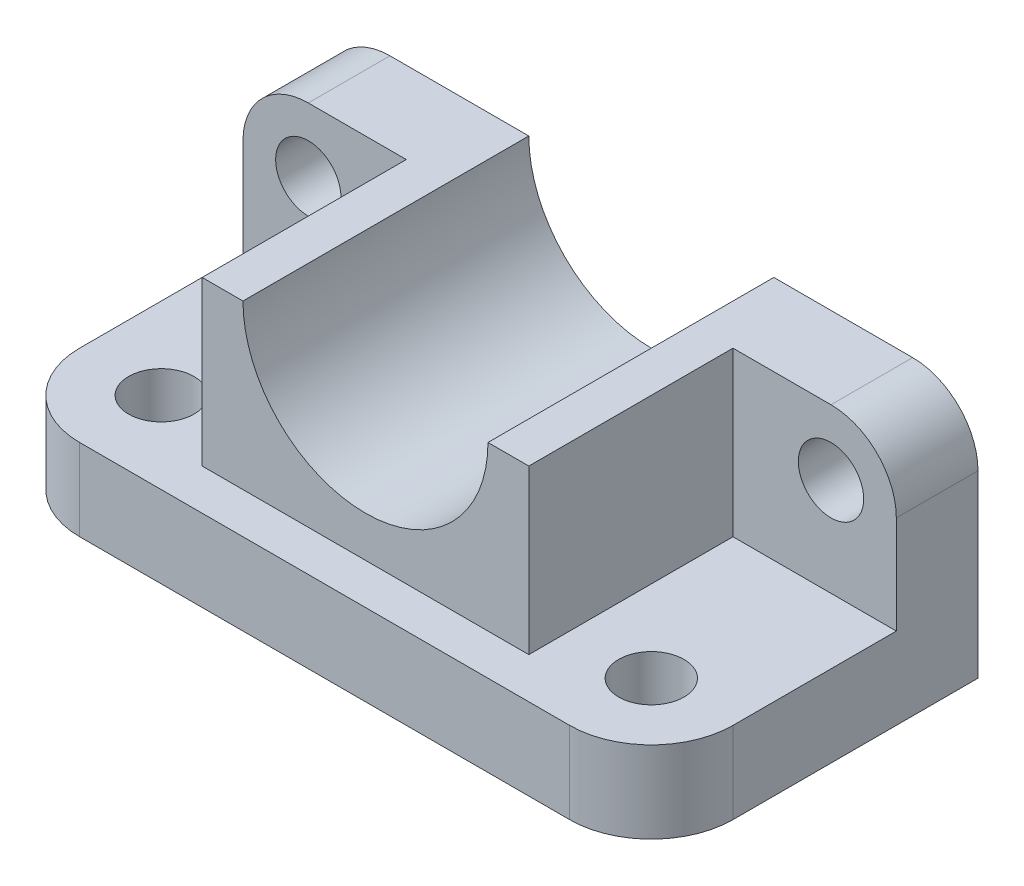
ISO-10303-21;
HEADER;
FILE_DESCRIPTION(('STEP AP214'),'2;1');
FILE_NAME('part.step','',(''),(''),'','','');
FILE_SCHEMA(('AUTOMOTIVE_DESIGN { 1 0 10303 214 1 1 1 1 }'));
ENDSEC;
DATA;
#1=APPLICATION_CONTEXT('core data for automotive mechanical design processes');
#2=APPLICATION_PROTOCOL_DEFINITION('international standard','automotive_design',2000,#1);
#3=PRODUCT_CONTEXT('',#1,'mechanical');
#4=PRODUCT('Part','Part','',(#3));
#5=PRODUCT_RELATED_PRODUCT_CATEGORY('part','',(#4));
#6=PRODUCT_DEFINITION_FORMATION('','',#4);
#7=PRODUCT_DEFINITION_CONTEXT('part definition',#1,'design');
#8=PRODUCT_DEFINITION('design','',#6,#7);
#9=PRODUCT_DEFINITION_SHAPE('','',#8);
#10=(LENGTH_UNIT() NAMED_UNIT(*) SI_UNIT(.MILLI.,.METRE.));
#11=(NAMED_UNIT(*) PLANE_ANGLE_UNIT() SI_UNIT($,.RADIAN.));
#12=(NAMED_UNIT(*) SI_UNIT($,.STERADIAN.) SOLID_ANGLE_UNIT());
#13=UNCERTAINTY_MEASURE_WITH_UNIT(LENGTH_MEASURE(1.E-05),#10,'distance_accuracy_value','');
#14=(GEOMETRIC_REPRESENTATION_CONTEXT(3) GLOBAL_UNCERTAINTY_ASSIGNED_CONTEXT((#13)) GLOBAL_UNIT_ASSIGNED_CONTEXT((#10,
#11,#12)) REPRESENTATION_CONTEXT('',''));
#15=CARTESIAN_POINT('',(0.,0.,0.));
#16=DIRECTION('',(0.,0.,1.));
#17=DIRECTION('',(1.,0.,0.));
#18=AXIS2_PLACEMENT_3D('',#15,#16,#17);
#19=CARTESIAN_POINT('',(-30.,30.,10.));
#20=DIRECTION('',(0.,-1.,0.));
#21=DIRECTION('',(0.,0.,-1.));
#22=AXIS2_PLACEMENT_3D('',#19,#20,#21);
#23=PLANE('',#22);
#24=DIRECTION('',(-1.,0.,0.));
#25=VECTOR('',#24,1.);
#26=CARTESIAN_POINT('',(-40.,30.,-20.));
#27=LINE('',#26,#25);
#28=CARTESIAN_POINT('',(32.,30.,-20.));
#29=VERTEX_POINT('',#28);
#30=CARTESIAN_POINT('',(15.,30.,-20.));
#31=VERTEX_POINT('',#30);
#32=EDGE_CURVE('E158',#29,#31,#27,.T.);
#33=ORIENTED_EDGE('',*,*,#32,.T.);
#34=DIRECTION('',(0.,0.,1.));
#35=VECTOR('',#34,1.);
#36=CARTESIAN_POINT('',(15.,30.,-20.));
#37=LINE('',#36,#35);
#38=CARTESIAN_POINT('',(15.,30.,15.));
#39=VERTEX_POINT('',#38);
#40=EDGE_CURVE('E145',#31,#39,#37,.T.);
#41=ORIENTED_EDGE('',*,*,#40,.T.);
#42=DIRECTION('',(-1.,0.,0.));
#43=VECTOR('',#42,1.);
#44=CARTESIAN_POINT('',(20.,30.,15.));
#45=LINE('',#44,#43);
#46=CARTESIAN_POINT('',(20.,30.,15.));
#47=VERTEX_POINT('',#46);
#48=EDGE_CURVE('E263',#47,#39,#45,.T.);
#49=ORIENTED_EDGE('',*,*,#48,.F.);
#50=DIRECTION('',(0.,0.,1.));
#51=VECTOR('',#50,1.);
#52=CARTESIAN_POINT('',(20.,30.,15.));
#53=LINE('',#52,#51);
#54=CARTESIAN_POINT('',(20.,30.,-10.));
#55=VERTEX_POINT('',#54);
#56=EDGE_CURVE('E259',#55,#47,#53,.T.);
#57=ORIENTED_EDGE('',*,*,#56,.F.);
#58=DIRECTION('',(-1.,0.,0.));
#59=VECTOR('',#58,1.);
#60=CARTESIAN_POINT('',(40.,30.,-10.));
#61=LINE('',#60,#59);
#62=CARTESIAN_POINT('',(32.,30.,-10.));
#63=VERTEX_POINT('',#62);
#64=EDGE_CURVE('E226',#63,#55,#61,.T.);
#65=ORIENTED_EDGE('',*,*,#64,.F.);
#66=DIRECTION('',(0.,0.,-1.));
#67=VECTOR('',#66,1.);
#68=CARTESIAN_POINT('',(32.,30.,10.));
#69=LINE('',#68,#67);
#70=EDGE_CURVE('E166',#63,#29,#69,.T.);
#71=ORIENTED_EDGE('',*,*,#70,.T.);
#72=EDGE_LOOP('',(#33,#41,#49,#57,#65,#71));
#73=FACE_BOUND('',#72,.T.);
#74=ADVANCED_FACE('F34',(#73),#23,.F.);
#75=CARTESIAN_POINT('',(-30.,30.,10.));
#76=DIRECTION('',(0.,-1.,0.));
#77=DIRECTION('',(0.,0.,-1.));
#78=AXIS2_PLACEMENT_3D('',#75,#76,#77);
#79=CYLINDRICAL_SURFACE('',#78,10.);
#80=CARTESIAN_POINT('',(-30.,10.,10.));
#81=DIRECTION('',(0.,1.,0.));
#82=DIRECTION('',(0.,0.,1.));
#83=AXIS2_PLACEMENT_3D('',#80,#81,#82);
#84=CIRCLE('',#83,10.);
#85=CARTESIAN_POINT('',(-40.,10.,9.99999999999993));
#86=VERTEX_POINT('',#85);
#87=CARTESIAN_POINT('',(-30.,10.,20.));
#88=VERTEX_POINT('',#87);
#89=EDGE_CURVE('E253',#86,#88,#84,.T.);
#90=ORIENTED_EDGE('',*,*,#89,.F.);
#91=DIRECTION('',(0.,-1.,0.));
#92=VECTOR('',#91,1.);
#93=CARTESIAN_POINT('',(-40.,30.,9.99999999999993));
#94=LINE('',#93,#92);
#95=CARTESIAN_POINT('',(-40.,0.,9.99999999999993));
#96=VERTEX_POINT('',#95);
#97=EDGE_CURVE('E196',#86,#96,#94,.T.);
#98=ORIENTED_EDGE('',*,*,#97,.T.);
#99=CARTESIAN_POINT('',(-30.,0.,10.));
#100=DIRECTION('',(0.,1.,0.));
#101=DIRECTION('',(0.,0.,-1.));
#102=AXIS2_PLACEMENT_3D('',#99,#100,#101);
#103=CIRCLE('',#102,10.);
#104=CARTESIAN_POINT('',(-29.9999999999999,0.,20.));
#105=VERTEX_POINT('',#104);
#106=EDGE_CURVE('E185',#96,#105,#103,.T.);
#107=ORIENTED_EDGE('',*,*,#106,.T.);
#108=DIRECTION('',(0.,-1.,0.));
#109=VECTOR('',#108,1.);
#110=CARTESIAN_POINT('',(-29.9999999999999,30.,20.));
#111=LINE('',#110,#109);
#112=EDGE_CURVE('E194',#88,#105,#111,.T.);
#113=ORIENTED_EDGE('',*,*,#112,.F.);
#114=EDGE_LOOP('',(#90,#98,#107,#113));
#115=FACE_BOUND('',#114,.T.);
#116=ADVANCED_FACE('F351',(#115),#79,.T.);
#117=CARTESIAN_POINT('',(-29.9999999999999,30.,20.));
#118=DIRECTION('',(0.,0.,-1.));
#119=DIRECTION('',(-1.,0.,0.));
#120=AXIS2_PLACEMENT_3D('',#117,#118,#119);
#121=PLANE('',#120);
#122=DIRECTION('',(1.,0.,0.));
#123=VECTOR('',#122,1.);
#124=CARTESIAN_POINT('',(-29.9999999999999,10.,20.));
#125=LINE('',#124,#123);
#126=CARTESIAN_POINT('',(29.9999999999999,10.,20.));
#127=VERTEX_POINT('',#126);
#128=EDGE_CURVE('E255',#88,#127,#125,.T.);
#129=ORIENTED_EDGE('',*,*,#128,.F.);
#130=ORIENTED_EDGE('',*,*,#112,.T.);
#131=DIRECTION('',(1.,0.,0.));
#132=VECTOR('',#131,1.);
#133=CARTESIAN_POINT('',(-29.9999999999999,0.,20.));
#134=LINE('',#133,#132);
#135=CARTESIAN_POINT('',(29.9999999999999,0.,20.));
#136=VERTEX_POINT('',#135);
#137=EDGE_CURVE('E188',#105,#136,#134,.T.);
#138=ORIENTED_EDGE('',*,*,#137,.T.);
#139=DIRECTION('',(0.,-1.,0.));
#140=VECTOR('',#139,1.);
#141=CARTESIAN_POINT('',(29.9999999999999,30.,20.));
#142=LINE('',#141,#140);
#143=EDGE_CURVE('E169',#127,#136,#142,.T.);
#144=ORIENTED_EDGE('',*,*,#143,.F.);
#145=EDGE_LOOP('',(#129,#130,#138,#144));
#146=FACE_BOUND('',#145,.T.);
#147=ADVANCED_FACE('F354',(#146),#121,.F.);
#148=CARTESIAN_POINT('',(30.,30.,10.));
#149=DIRECTION('',(0.,-1.,0.));
#150=DIRECTION('',(0.,0.,-1.));
#151=AXIS2_PLACEMENT_3D('',#148,#149,#150);
#152=CYLINDRICAL_SURFACE('',#151,10.);
#153=CARTESIAN_POINT('',(30.,10.,10.));
#154=DIRECTION('',(0.,1.,0.));
#155=DIRECTION('',(0.,0.,1.));
#156=AXIS2_PLACEMENT_3D('',#153,#154,#155);
#157=CIRCLE('',#156,10.);
#158=CARTESIAN_POINT('',(40.,10.,9.99999999999993));
#159=VERTEX_POINT('',#158);
#160=EDGE_CURVE('E230',#127,#159,#157,.T.);
#161=ORIENTED_EDGE('',*,*,#160,.F.);
#162=ORIENTED_EDGE('',*,*,#143,.T.);
#163=CARTESIAN_POINT('',(30.,0.,10.));
#164=DIRECTION('',(0.,1.,0.));
#165=DIRECTION('',(0.,0.,-1.));
#166=AXIS2_PLACEMENT_3D('',#163,#164,#165);
#167=CIRCLE('',#166,10.);
#168=CARTESIAN_POINT('',(40.,0.,9.99999999999993));
#169=VERTEX_POINT('',#168);
#170=EDGE_CURVE('E171',#136,#169,#167,.T.);
#171=ORIENTED_EDGE('',*,*,#170,.T.);
#172=DIRECTION('',(0.,-1.,0.));
#173=VECTOR('',#172,1.);
#174=CARTESIAN_POINT('',(40.,30.,9.99999999999993));
#175=LINE('',#174,#173);
#176=EDGE_CURVE('E167',#159,#169,#175,.T.);
#177=ORIENTED_EDGE('',*,*,#176,.F.);
#178=EDGE_LOOP('',(#161,#162,#171,#177));
#179=FACE_BOUND('',#178,.T.);
#180=ADVANCED_FACE('F297',(#179),#152,.T.);
#181=CARTESIAN_POINT('',(-30.,30.,10.));
#182=DIRECTION('',(0.,-1.,0.));
#183=DIRECTION('',(0.,0.,-1.));
#184=AXIS2_PLACEMENT_3D('',#181,#182,#183);
#185=CYLINDRICAL_SURFACE('',#184,4.);
#186=CARTESIAN_POINT('',(-30.,0.,10.));
#187=DIRECTION('',(0.,1.,0.));
#188=DIRECTION('',(0.,0.,1.));
#189=AXIS2_PLACEMENT_3D('',#186,#187,#188);
#190=CIRCLE('',#189,4.);
#191=CARTESIAN_POINT('',(-30.,0.,14.));
#192=VERTEX_POINT('',#191);
#193=EDGE_CURVE('E174',#192,#192,#190,.T.);
#194=ORIENTED_EDGE('',*,*,#193,.F.);
#195=EDGE_LOOP('',(#194));
#196=FACE_BOUND('',#195,.T.);
#197=CARTESIAN_POINT('',(-30.,10.,10.));
#198=DIRECTION('',(0.,1.,0.));
#199=DIRECTION('',(0.,0.,1.));
#200=AXIS2_PLACEMENT_3D('',#197,#198,#199);
#201=CIRCLE('',#200,4.);
#202=CARTESIAN_POINT('',(-30.,10.,14.));
#203=VERTEX_POINT('',#202);
#204=EDGE_CURVE('E206',#203,#203,#201,.T.);
#205=ORIENTED_EDGE('',*,*,#204,.T.);
#206=EDGE_LOOP('',(#205));
#207=FACE_BOUND('',#206,.T.);
#208=ADVANCED_FACE('F293',(#196,#207),#185,.F.);
#209=CARTESIAN_POINT('',(30.,30.,10.));
#210=DIRECTION('',(0.,-1.,0.));
#211=DIRECTION('',(0.,0.,-1.));
#212=AXIS2_PLACEMENT_3D('',#209,#210,#211);
#213=CYLINDRICAL_SURFACE('',#212,4.);
#214=CARTESIAN_POINT('',(30.,0.,10.));
#215=DIRECTION('',(0.,1.,0.));
#216=DIRECTION('',(0.,0.,1.));
#217=AXIS2_PLACEMENT_3D('',#214,#215,#216);
#218=CIRCLE('',#217,4.);
#219=CARTESIAN_POINT('',(30.,0.,14.));
#220=VERTEX_POINT('',#219);
#221=EDGE_CURVE('E283',#220,#220,#218,.T.);
#222=ORIENTED_EDGE('',*,*,#221,.F.);
#223=EDGE_LOOP('',(#222));
#224=FACE_BOUND('',#223,.T.);
#225=CARTESIAN_POINT('',(30.,10.,10.));
#226=DIRECTION('',(0.,1.,0.));
#227=DIRECTION('',(0.,0.,1.));
#228=AXIS2_PLACEMENT_3D('',#225,#226,#227);
#229=CIRCLE('',#228,4.);
#230=CARTESIAN_POINT('',(30.,10.,14.));
#231=VERTEX_POINT('',#230);
#232=EDGE_CURVE('E203',#231,#231,#229,.T.);
#233=ORIENTED_EDGE('',*,*,#232,.T.);
#234=EDGE_LOOP('',(#233));
#235=FACE_BOUND('',#234,.T.);
#236=ADVANCED_FACE('F296',(#224,#235),#213,.F.);
#237=CARTESIAN_POINT('',(-15.,30.,15.));
#238=VERTEX_POINT('',#237);
#239=CARTESIAN_POINT('',(-20.,30.,15.));
#240=VERTEX_POINT('',#239);
#241=EDGE_CURVE('E262',#238,#240,#45,.T.);
#242=ORIENTED_EDGE('',*,*,#241,.F.);
#243=DIRECTION('',(0.,0.,1.));
#244=VECTOR('',#243,1.);
#245=CARTESIAN_POINT('',(-15.,30.,-20.));
#246=LINE('',#245,#244);
#247=CARTESIAN_POINT('',(-15.,30.,-20.));
#248=VERTEX_POINT('',#247);
#249=EDGE_CURVE('E50',#248,#238,#246,.T.);
#250=ORIENTED_EDGE('',*,*,#249,.F.);
#251=CARTESIAN_POINT('',(-32.,30.,-20.));
#252=VERTEX_POINT('',#251);
#253=EDGE_CURVE('E160',#248,#252,#27,.T.);
#254=ORIENTED_EDGE('',*,*,#253,.T.);
#255=DIRECTION('',(0.,0.,1.));
#256=VECTOR('',#255,1.);
#257=CARTESIAN_POINT('',(-32.,30.,10.));
#258=LINE('',#257,#256);
#259=CARTESIAN_POINT('',(-32.,30.,-10.));
#260=VERTEX_POINT('',#259);
#261=EDGE_CURVE('E202',#252,#260,#258,.T.);
#262=ORIENTED_EDGE('',*,*,#261,.T.);
#263=DIRECTION('',(-1.,0.,0.));
#264=VECTOR('',#263,1.);
#265=CARTESIAN_POINT('',(-20.,30.,-10.));
#266=LINE('',#265,#264);
#267=CARTESIAN_POINT('',(-20.,30.,-10.));
#268=VERTEX_POINT('',#267);
#269=EDGE_CURVE('E233',#268,#260,#266,.T.);
#270=ORIENTED_EDGE('',*,*,#269,.F.);
#271=DIRECTION('',(0.,0.,-1.));
#272=VECTOR('',#271,1.);
#273=CARTESIAN_POINT('',(-20.,30.,-10.));
#274=LINE('',#273,#272);
#275=EDGE_CURVE('E265',#240,#268,#274,.T.);
#276=ORIENTED_EDGE('',*,*,#275,.F.);
#277=EDGE_LOOP('',(#242,#250,#254,#262,#270,#276));
#278=FACE_BOUND('',#277,.T.);
#279=ADVANCED_FACE('F365',(#278),#23,.F.);
#280=CARTESIAN_POINT('',(-30.,0.,10.));
#281=DIRECTION('',(0.,-1.,0.));
#282=DIRECTION('',(0.,0.,-1.));
#283=AXIS2_PLACEMENT_3D('',#280,#281,#282);
#284=PLANE('',#283);
#285=ORIENTED_EDGE('',*,*,#193,.T.);
#286=EDGE_LOOP('',(#285));
#287=FACE_BOUND('',#286,.T.);
#288=DIRECTION('',(0.,0.,-1.));
#289=VECTOR('',#288,1.);
#290=CARTESIAN_POINT('',(40.,0.,9.99999999999993));
#291=LINE('',#290,#289);
#292=CARTESIAN_POINT('',(40.,0.,-20.));
#293=VERTEX_POINT('',#292);
#294=EDGE_CURVE('E176',#169,#293,#291,.T.);
#295=ORIENTED_EDGE('',*,*,#294,.F.);
#296=ORIENTED_EDGE('',*,*,#170,.F.);
#297=ORIENTED_EDGE('',*,*,#137,.F.);
#298=ORIENTED_EDGE('',*,*,#106,.F.);
#299=DIRECTION('',(0.,0.,1.));
#300=VECTOR('',#299,1.);
#301=CARTESIAN_POINT('',(-40.,0.,9.99999999999993));
#302=LINE('',#301,#300);
#303=CARTESIAN_POINT('',(-40.,0.,-20.));
#304=VERTEX_POINT('',#303);
#305=EDGE_CURVE('E182',#304,#96,#302,.T.);
#306=ORIENTED_EDGE('',*,*,#305,.F.);
#307=DIRECTION('',(-1.,0.,0.));
#308=VECTOR('',#307,1.);
#309=CARTESIAN_POINT('',(-40.,0.,-20.));
#310=LINE('',#309,#308);
#311=EDGE_CURVE('E179',#293,#304,#310,.T.);
#312=ORIENTED_EDGE('',*,*,#311,.F.);
#313=EDGE_LOOP('',(#295,#296,#297,#298,#306,#312));
#314=FACE_BOUND('',#313,.T.);
#315=ORIENTED_EDGE('',*,*,#221,.T.);
#316=EDGE_LOOP('',(#315));
#317=FACE_BOUND('',#316,.T.);
#318=ADVANCED_FACE('F290',(#287,#314,#317),#284,.T.);
#319=CARTESIAN_POINT('',(40.,30.,9.99999999999993));
#320=DIRECTION('',(-1.,0.,0.));
#321=DIRECTION('',(0.,0.,1.));
#322=AXIS2_PLACEMENT_3D('',#319,#320,#321);
#323=PLANE('',#322);
#324=DIRECTION('',(0.,-1.,0.));
#325=VECTOR('',#324,1.);
#326=CARTESIAN_POINT('',(40.,30.,-20.));
#327=LINE('',#326,#325);
#328=CARTESIAN_POINT('',(40.,22.,-20.));
#329=VERTEX_POINT('',#328);
#330=EDGE_CURVE('E200',#329,#293,#327,.T.);
#331=ORIENTED_EDGE('',*,*,#330,.F.);
#332=DIRECTION('',(0.,0.,-1.));
#333=VECTOR('',#332,1.);
#334=CARTESIAN_POINT('',(40.,22.,9.99999999999993));
#335=LINE('',#334,#333);
#336=CARTESIAN_POINT('',(40.,22.,-10.));
#337=VERTEX_POINT('',#336);
#338=EDGE_CURVE('E215',#329,#337,#335,.F.);
#339=ORIENTED_EDGE('',*,*,#338,.T.);
#340=DIRECTION('',(0.,1.,0.));
#341=VECTOR('',#340,1.);
#342=CARTESIAN_POINT('',(40.,10.,-10.));
#343=LINE('',#342,#341);
#344=CARTESIAN_POINT('',(40.,10.,-10.));
#345=VERTEX_POINT('',#344);
#346=EDGE_CURVE('E257',#345,#337,#343,.T.);
#347=ORIENTED_EDGE('',*,*,#346,.F.);
#348=DIRECTION('',(0.,0.,-1.));
#349=VECTOR('',#348,1.);
#350=CARTESIAN_POINT('',(40.,10.,9.99999999999993));
#351=LINE('',#350,#349);
#352=EDGE_CURVE('E232',#159,#345,#351,.T.);
#353=ORIENTED_EDGE('',*,*,#352,.F.);
#354=ORIENTED_EDGE('',*,*,#176,.T.);
#355=ORIENTED_EDGE('',*,*,#294,.T.);
#356=EDGE_LOOP('',(#331,#339,#347,#353,#354,#355));
#357=FACE_BOUND('',#356,.T.);
#358=ADVANCED_FACE('F318',(#357),#323,.F.);
#359=CARTESIAN_POINT('',(-40.,30.,-20.));
#360=DIRECTION('',(0.,0.,1.));
#361=DIRECTION('',(1.,0.,0.));
#362=AXIS2_PLACEMENT_3D('',#359,#360,#361);
#363=PLANE('',#362);
#364=CARTESIAN_POINT('',(32.,22.,-20.));
#365=DIRECTION('',(0.,0.,1.));
#366=DIRECTION('',(1.,0.,0.));
#367=AXIS2_PLACEMENT_3D('',#364,#365,#366);
#368=CIRCLE('',#367,4.00000000000001);
#369=CARTESIAN_POINT('',(36.,22.,-20.));
#370=VERTEX_POINT('',#369);
#371=EDGE_CURVE('E543',#370,#370,#368,.T.);
#372=ORIENTED_EDGE('',*,*,#371,.T.);
#373=EDGE_LOOP('',(#372));
#374=FACE_BOUND('',#373,.T.);
#375=CARTESIAN_POINT('',(-32.,22.,-20.));
#376=DIRECTION('',(0.,0.,1.));
#377=DIRECTION('',(1.,0.,0.));
#378=AXIS2_PLACEMENT_3D('',#375,#376,#377);
#379=CIRCLE('',#378,4.);
#380=CARTESIAN_POINT('',(-28.,22.,-20.));
#381=VERTEX_POINT('',#380);
#382=EDGE_CURVE('E161',#381,#381,#379,.T.);
#383=ORIENTED_EDGE('',*,*,#382,.T.);
#384=EDGE_LOOP('',(#383));
#385=FACE_BOUND('',#384,.T.);
#386=ORIENTED_EDGE('',*,*,#253,.F.);
#387=CARTESIAN_POINT('',(0.,30.,-20.));
#388=DIRECTION('',(0.,0.,1.));
#389=DIRECTION('',(1.,0.,0.));
#390=AXIS2_PLACEMENT_3D('',#387,#388,#389);
#391=CIRCLE('',#390,15.);
#392=EDGE_CURVE('E148',#248,#31,#391,.T.);
#393=ORIENTED_EDGE('',*,*,#392,.T.);
#394=ORIENTED_EDGE('',*,*,#32,.F.);
#395=CARTESIAN_POINT('',(32.,22.,-20.));
#396=DIRECTION('',(0.,0.,1.));
#397=DIRECTION('',(1.,0.,0.));
#398=AXIS2_PLACEMENT_3D('',#395,#396,#397);
#399=CIRCLE('',#398,8.);
#400=EDGE_CURVE('E213',#29,#329,#399,.F.);
#401=ORIENTED_EDGE('',*,*,#400,.T.);
#402=ORIENTED_EDGE('',*,*,#330,.T.);
#403=ORIENTED_EDGE('',*,*,#311,.T.);
#404=DIRECTION('',(0.,-1.,0.));
#405=VECTOR('',#404,1.);
#406=CARTESIAN_POINT('',(-40.,30.,-20.));
#407=LINE('',#406,#405);
#408=CARTESIAN_POINT('',(-40.,22.,-20.));
#409=VERTEX_POINT('',#408);
#410=EDGE_CURVE('E198',#409,#304,#407,.T.);
#411=ORIENTED_EDGE('',*,*,#410,.F.);
#412=CARTESIAN_POINT('',(-32.,22.,-20.));
#413=DIRECTION('',(0.,0.,1.));
#414=DIRECTION('',(1.,0.,0.));
#415=AXIS2_PLACEMENT_3D('',#412,#413,#414);
#416=CIRCLE('',#415,8.);
#417=EDGE_CURVE('E211',#409,#252,#416,.F.);
#418=ORIENTED_EDGE('',*,*,#417,.T.);
#419=EDGE_LOOP('',(#386,#393,#394,#401,#402,#403,#411,#418));
#420=FACE_BOUND('',#419,.T.);
#421=ADVANCED_FACE('F157',(#374,#385,#420),#363,.F.);
#422=CARTESIAN_POINT('',(-40.,30.,9.99999999999993));
#423=DIRECTION('',(1.,0.,0.));
#424=DIRECTION('',(0.,0.,-1.));
#425=AXIS2_PLACEMENT_3D('',#422,#423,#424);
#426=PLANE('',#425);
#427=DIRECTION('',(0.,1.,0.));
#428=VECTOR('',#427,1.);
#429=CARTESIAN_POINT('',(-40.,10.,-10.));
#430=LINE('',#429,#428);
#431=CARTESIAN_POINT('',(-40.,10.,-10.));
#432=VERTEX_POINT('',#431);
#433=CARTESIAN_POINT('',(-40.,22.,-10.));
#434=VERTEX_POINT('',#433);
#435=EDGE_CURVE('E207',#432,#434,#430,.T.);
#436=ORIENTED_EDGE('',*,*,#435,.T.);
#437=DIRECTION('',(0.,0.,1.));
#438=VECTOR('',#437,1.);
#439=CARTESIAN_POINT('',(-40.,22.,9.99999999999993));
#440=LINE('',#439,#438);
#441=EDGE_CURVE('E43',#434,#409,#440,.F.);
#442=ORIENTED_EDGE('',*,*,#441,.T.);
#443=ORIENTED_EDGE('',*,*,#410,.T.);
#444=ORIENTED_EDGE('',*,*,#305,.T.);
#445=ORIENTED_EDGE('',*,*,#97,.F.);
#446=DIRECTION('',(0.,0.,1.));
#447=VECTOR('',#446,1.);
#448=CARTESIAN_POINT('',(-40.,10.,-10.));
#449=LINE('',#448,#447);
#450=EDGE_CURVE('E251',#432,#86,#449,.T.);
#451=ORIENTED_EDGE('',*,*,#450,.F.);
#452=EDGE_LOOP('',(#436,#442,#443,#444,#445,#451));
#453=FACE_BOUND('',#452,.T.);
#454=ADVANCED_FACE('F347',(#453),#426,.F.);
#455=CARTESIAN_POINT('',(-20.,10.,-10.));
#456=DIRECTION('',(0.,0.,-1.));
#457=DIRECTION('',(-1.,0.,0.));
#458=AXIS2_PLACEMENT_3D('',#455,#456,#457);
#459=PLANE('',#458);
#460=CARTESIAN_POINT('',(-32.,22.,-10.));
#461=DIRECTION('',(0.,0.,-1.));
#462=DIRECTION('',(-1.,0.,0.));
#463=AXIS2_PLACEMENT_3D('',#460,#461,#462);
#464=CIRCLE('',#463,4.);
#465=CARTESIAN_POINT('',(-36.,22.,-10.));
#466=VERTEX_POINT('',#465);
#467=EDGE_CURVE('E38',#466,#466,#464,.T.);
#468=ORIENTED_EDGE('',*,*,#467,.T.);
#469=EDGE_LOOP('',(#468));
#470=FACE_BOUND('',#469,.T.);
#471=ORIENTED_EDGE('',*,*,#269,.T.);
#472=CARTESIAN_POINT('',(-32.,22.,-10.));
#473=DIRECTION('',(0.,0.,-1.));
#474=DIRECTION('',(-1.,0.,0.));
#475=AXIS2_PLACEMENT_3D('',#472,#473,#474);
#476=CIRCLE('',#475,8.);
#477=EDGE_CURVE('E57',#260,#434,#476,.F.);
#478=ORIENTED_EDGE('',*,*,#477,.T.);
#479=ORIENTED_EDGE('',*,*,#435,.F.);
#480=DIRECTION('',(-1.,0.,0.));
#481=VECTOR('',#480,1.);
#482=CARTESIAN_POINT('',(-20.,10.,-10.));
#483=LINE('',#482,#481);
#484=CARTESIAN_POINT('',(-20.,10.,-10.));
#485=VERTEX_POINT('',#484);
#486=EDGE_CURVE('E248',#485,#432,#483,.T.);
#487=ORIENTED_EDGE('',*,*,#486,.F.);
#488=DIRECTION('',(0.,1.,0.));
#489=VECTOR('',#488,1.);
#490=CARTESIAN_POINT('',(-20.,10.,-10.));
#491=LINE('',#490,#489);
#492=EDGE_CURVE('E270',#485,#268,#491,.T.);
#493=ORIENTED_EDGE('',*,*,#492,.T.);
#494=EDGE_LOOP('',(#471,#478,#479,#487,#493));
#495=FACE_BOUND('',#494,.T.);
#496=ADVANCED_FACE('F342',(#470,#495),#459,.F.);
#497=CARTESIAN_POINT('',(-20.,10.,-10.));
#498=DIRECTION('',(1.,0.,0.));
#499=DIRECTION('',(0.,0.,-1.));
#500=AXIS2_PLACEMENT_3D('',#497,#498,#499);
#501=PLANE('',#500);
#502=ORIENTED_EDGE('',*,*,#275,.T.);
#503=ORIENTED_EDGE('',*,*,#492,.F.);
#504=DIRECTION('',(0.,0.,-1.));
#505=VECTOR('',#504,1.);
#506=CARTESIAN_POINT('',(-20.,10.,-10.));
#507=LINE('',#506,#505);
#508=CARTESIAN_POINT('',(-20.,10.,15.));
#509=VERTEX_POINT('',#508);
#510=EDGE_CURVE('E245',#509,#485,#507,.T.);
#511=ORIENTED_EDGE('',*,*,#510,.F.);
#512=DIRECTION('',(0.,1.,0.));
#513=VECTOR('',#512,1.);
#514=CARTESIAN_POINT('',(-20.,10.,15.));
#515=LINE('',#514,#513);
#516=EDGE_CURVE('E272',#509,#240,#515,.T.);
#517=ORIENTED_EDGE('',*,*,#516,.T.);
#518=EDGE_LOOP('',(#502,#503,#511,#517));
#519=FACE_BOUND('',#518,.T.);
#520=ADVANCED_FACE('F339',(#519),#501,.F.);
#521=CARTESIAN_POINT('',(20.,10.,15.));
#522=DIRECTION('',(0.,0.,-1.));
#523=DIRECTION('',(-1.,0.,0.));
#524=AXIS2_PLACEMENT_3D('',#521,#522,#523);
#525=PLANE('',#524);
#526=ORIENTED_EDGE('',*,*,#48,.T.);
#527=CARTESIAN_POINT('',(0.,30.,15.));
#528=DIRECTION('',(0.,0.,-1.));
#529=DIRECTION('',(-1.,0.,0.));
#530=AXIS2_PLACEMENT_3D('',#527,#528,#529);
#531=CIRCLE('',#530,15.);
#532=EDGE_CURVE('E11',#39,#238,#531,.T.);
#533=ORIENTED_EDGE('',*,*,#532,.T.);
#534=ORIENTED_EDGE('',*,*,#241,.T.);
#535=ORIENTED_EDGE('',*,*,#516,.F.);
#536=DIRECTION('',(-1.,0.,0.));
#537=VECTOR('',#536,1.);
#538=CARTESIAN_POINT('',(20.,10.,15.));
#539=LINE('',#538,#537);
#540=CARTESIAN_POINT('',(20.,10.,15.));
#541=VERTEX_POINT('',#540);
#542=EDGE_CURVE('E242',#541,#509,#539,.T.);
#543=ORIENTED_EDGE('',*,*,#542,.F.);
#544=DIRECTION('',(0.,1.,0.));
#545=VECTOR('',#544,1.);
#546=CARTESIAN_POINT('',(20.,10.,15.));
#547=LINE('',#546,#545);
#548=EDGE_CURVE('E275',#541,#47,#547,.T.);
#549=ORIENTED_EDGE('',*,*,#548,.T.);
#550=EDGE_LOOP('',(#526,#533,#534,#535,#543,#549));
#551=FACE_BOUND('',#550,.T.);
#552=ADVANCED_FACE('F335',(#551),#525,.F.);
#553=CARTESIAN_POINT('',(20.,10.,15.));
#554=DIRECTION('',(-1.,0.,0.));
#555=DIRECTION('',(0.,0.,1.));
#556=AXIS2_PLACEMENT_3D('',#553,#554,#555);
#557=PLANE('',#556);
#558=ORIENTED_EDGE('',*,*,#56,.T.);
#559=ORIENTED_EDGE('',*,*,#548,.F.);
#560=DIRECTION('',(0.,0.,1.));
#561=VECTOR('',#560,1.);
#562=CARTESIAN_POINT('',(20.,10.,15.));
#563=LINE('',#562,#561);
#564=CARTESIAN_POINT('',(20.,10.,-10.));
#565=VERTEX_POINT('',#564);
#566=EDGE_CURVE('E239',#565,#541,#563,.T.);
#567=ORIENTED_EDGE('',*,*,#566,.F.);
#568=DIRECTION('',(0.,1.,0.));
#569=VECTOR('',#568,1.);
#570=CARTESIAN_POINT('',(20.,10.,-10.));
#571=LINE('',#570,#569);
#572=EDGE_CURVE('E277',#565,#55,#571,.T.);
#573=ORIENTED_EDGE('',*,*,#572,.T.);
#574=EDGE_LOOP('',(#558,#559,#567,#573));
#575=FACE_BOUND('',#574,.T.);
#576=ADVANCED_FACE('F330',(#575),#557,.F.);
#577=CARTESIAN_POINT('',(40.,10.,-10.));
#578=DIRECTION('',(0.,0.,-1.));
#579=DIRECTION('',(-1.,0.,0.));
#580=AXIS2_PLACEMENT_3D('',#577,#578,#579);
#581=PLANE('',#580);
#582=CARTESIAN_POINT('',(32.,22.,-10.));
#583=DIRECTION('',(0.,0.,-1.));
#584=DIRECTION('',(-1.,0.,0.));
#585=AXIS2_PLACEMENT_3D('',#582,#583,#584);
#586=CIRCLE('',#585,4.00000000000001);
#587=CARTESIAN_POINT('',(28.,22.,-10.));
#588=VERTEX_POINT('',#587);
#589=EDGE_CURVE('E221',#588,#588,#586,.T.);
#590=ORIENTED_EDGE('',*,*,#589,.T.);
#591=EDGE_LOOP('',(#590));
#592=FACE_BOUND('',#591,.T.);
#593=ORIENTED_EDGE('',*,*,#346,.T.);
#594=CARTESIAN_POINT('',(32.,22.,-10.));
#595=DIRECTION('',(0.,0.,-1.));
#596=DIRECTION('',(-1.,0.,0.));
#597=AXIS2_PLACEMENT_3D('',#594,#595,#596);
#598=CIRCLE('',#597,8.);
#599=EDGE_CURVE('E217',#337,#63,#598,.F.);
#600=ORIENTED_EDGE('',*,*,#599,.T.);
#601=ORIENTED_EDGE('',*,*,#64,.T.);
#602=ORIENTED_EDGE('',*,*,#572,.F.);
#603=DIRECTION('',(-1.,0.,0.));
#604=VECTOR('',#603,1.);
#605=CARTESIAN_POINT('',(40.,10.,-10.));
#606=LINE('',#605,#604);
#607=EDGE_CURVE('E236',#345,#565,#606,.T.);
#608=ORIENTED_EDGE('',*,*,#607,.F.);
#609=EDGE_LOOP('',(#593,#600,#601,#602,#608));
#610=FACE_BOUND('',#609,.T.);
#611=ADVANCED_FACE('F305',(#592,#610),#581,.F.);
#612=CARTESIAN_POINT('',(30.,10.,10.));
#613=DIRECTION('',(0.,1.,0.));
#614=DIRECTION('',(0.,0.,1.));
#615=AXIS2_PLACEMENT_3D('',#612,#613,#614);
#616=PLANE('',#615);
#617=ORIENTED_EDGE('',*,*,#204,.F.);
#618=EDGE_LOOP('',(#617));
#619=FACE_BOUND('',#618,.T.);
#620=ORIENTED_EDGE('',*,*,#232,.F.);
#621=EDGE_LOOP('',(#620));
#622=FACE_BOUND('',#621,.T.);
#623=ORIENTED_EDGE('',*,*,#160,.T.);
#624=ORIENTED_EDGE('',*,*,#352,.T.);
#625=ORIENTED_EDGE('',*,*,#607,.T.);
#626=ORIENTED_EDGE('',*,*,#566,.T.);
#627=ORIENTED_EDGE('',*,*,#542,.T.);
#628=ORIENTED_EDGE('',*,*,#510,.T.);
#629=ORIENTED_EDGE('',*,*,#486,.T.);
#630=ORIENTED_EDGE('',*,*,#450,.T.);
#631=ORIENTED_EDGE('',*,*,#89,.T.);
#632=ORIENTED_EDGE('',*,*,#128,.T.);
#633=EDGE_LOOP('',(#623,#624,#625,#626,#627,#628,#629,#630,#631,#632));
#634=FACE_BOUND('',#633,.T.);
#635=ADVANCED_FACE('F301',(#619,#622,#634),#616,.T.);
#636=CARTESIAN_POINT('',(32.,22.,10.));
#637=DIRECTION('',(0.,0.,-1.));
#638=DIRECTION('',(-1.,0.,0.));
#639=AXIS2_PLACEMENT_3D('',#636,#637,#638);
#640=CYLINDRICAL_SURFACE('',#639,8.);
#641=ORIENTED_EDGE('',*,*,#599,.F.);
#642=ORIENTED_EDGE('',*,*,#338,.F.);
#643=ORIENTED_EDGE('',*,*,#400,.F.);
#644=ORIENTED_EDGE('',*,*,#70,.F.);
#645=EDGE_LOOP('',(#641,#642,#643,#644));
#646=FACE_BOUND('',#645,.T.);
#647=ADVANCED_FACE('F304',(#646),#640,.T.);
#648=CARTESIAN_POINT('',(-32.,22.,10.));
#649=DIRECTION('',(0.,0.,1.));
#650=DIRECTION('',(1.,0.,0.));
#651=AXIS2_PLACEMENT_3D('',#648,#649,#650);
#652=CYLINDRICAL_SURFACE('',#651,8.);
#653=ORIENTED_EDGE('',*,*,#417,.F.);
#654=ORIENTED_EDGE('',*,*,#441,.F.);
#655=ORIENTED_EDGE('',*,*,#477,.F.);
#656=ORIENTED_EDGE('',*,*,#261,.F.);
#657=EDGE_LOOP('',(#653,#654,#655,#656));
#658=FACE_BOUND('',#657,.T.);
#659=ADVANCED_FACE('F36',(#658),#652,.T.);
#660=CARTESIAN_POINT('',(32.,22.,-20.));
#661=DIRECTION('',(0.,0.,1.));
#662=DIRECTION('',(1.,0.,0.));
#663=AXIS2_PLACEMENT_3D('',#660,#661,#662);
#664=CYLINDRICAL_SURFACE('',#663,4.00000000000001);
#665=ORIENTED_EDGE('',*,*,#371,.F.);
#666=EDGE_LOOP('',(#665));
#667=FACE_BOUND('',#666,.T.);
#668=ORIENTED_EDGE('',*,*,#589,.F.);
#669=EDGE_LOOP('',(#668));
#670=FACE_BOUND('',#669,.T.);
#671=ADVANCED_FACE('F382',(#667,#670),#664,.F.);
#672=CARTESIAN_POINT('',(0.,30.,-20.));
#673=DIRECTION('',(0.,0.,1.));
#674=DIRECTION('',(1.,0.,0.));
#675=AXIS2_PLACEMENT_3D('',#672,#673,#674);
#676=CYLINDRICAL_SURFACE('',#675,15.);
#677=ORIENTED_EDGE('',*,*,#40,.F.);
#678=ORIENTED_EDGE('',*,*,#392,.F.);
#679=ORIENTED_EDGE('',*,*,#249,.T.);
#680=ORIENTED_EDGE('',*,*,#532,.F.);
#681=EDGE_LOOP('',(#677,#678,#679,#680));
#682=FACE_BOUND('',#681,.T.);
#683=ADVANCED_FACE('F147',(#682),#676,.F.);
#684=CARTESIAN_POINT('',(-32.,22.,-20.));
#685=DIRECTION('',(0.,0.,1.));
#686=DIRECTION('',(1.,0.,0.));
#687=AXIS2_PLACEMENT_3D('',#684,#685,#686);
#688=CYLINDRICAL_SURFACE('',#687,4.);
#689=ORIENTED_EDGE('',*,*,#382,.F.);
#690=EDGE_LOOP('',(#689));
#691=FACE_BOUND('',#690,.T.);
#692=ORIENTED_EDGE('',*,*,#467,.F.);
#693=EDGE_LOOP('',(#692));
#694=FACE_BOUND('',#693,.T.);
#695=ADVANCED_FACE('F525',(#691,#694),#688,.F.);
#696=CLOSED_SHELL('',(#74,#116,#147,#180,#208,#236,#279,#318,#358,#421,#454,#496,#520,#552,#576,
#611,#635,#647,#659,#671,#683,#695));
#697=MANIFOLD_SOLID_BREP('B2',#696);
#698=ADVANCED_BREP_SHAPE_REPRESENTATION('',(#18,#697),#14);
#699=SHAPE_DEFINITION_REPRESENTATION(#9,#698);
ENDSEC;
END-ISO-10303-21;
